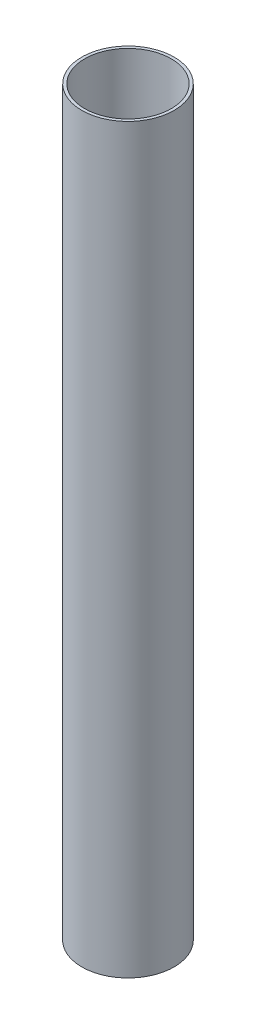
ISO-10303-21;
HEADER;
FILE_DESCRIPTION(('STEP AP214'),'2;1');
FILE_NAME('part.step','',(''),(''),'','','');
FILE_SCHEMA(('AUTOMOTIVE_DESIGN { 1 0 10303 214 1 1 1 1 }'));
ENDSEC;
DATA;
#1=APPLICATION_CONTEXT('core data for automotive mechanical design processes');
#2=APPLICATION_PROTOCOL_DEFINITION('international standard','automotive_design',2000,#1);
#3=PRODUCT_CONTEXT('',#1,'mechanical');
#4=PRODUCT('Part','Part','',(#3));
#5=PRODUCT_RELATED_PRODUCT_CATEGORY('part','',(#4));
#6=PRODUCT_DEFINITION_FORMATION('','',#4);
#7=PRODUCT_DEFINITION_CONTEXT('part definition',#1,'design');
#8=PRODUCT_DEFINITION('design','',#6,#7);
#9=PRODUCT_DEFINITION_SHAPE('','',#8);
#10=(LENGTH_UNIT() NAMED_UNIT(*) SI_UNIT(.MILLI.,.METRE.));
#11=(NAMED_UNIT(*) PLANE_ANGLE_UNIT() SI_UNIT($,.RADIAN.));
#12=(NAMED_UNIT(*) SI_UNIT($,.STERADIAN.) SOLID_ANGLE_UNIT());
#13=UNCERTAINTY_MEASURE_WITH_UNIT(LENGTH_MEASURE(1.E-05),#10,'distance_accuracy_value','');
#14=(GEOMETRIC_REPRESENTATION_CONTEXT(3) GLOBAL_UNCERTAINTY_ASSIGNED_CONTEXT((#13)) GLOBAL_UNIT_ASSIGNED_CONTEXT((#10,
#11,#12)) REPRESENTATION_CONTEXT('',''));
#15=CARTESIAN_POINT('',(0.,0.,0.));
#16=DIRECTION('',(0.,0.,1.));
#17=DIRECTION('',(1.,0.,0.));
#18=AXIS2_PLACEMENT_3D('',#15,#16,#17);
#19=CARTESIAN_POINT('',(0.,762.,0.));
#20=DIRECTION('',(0.,1.,0.));
#21=DIRECTION('',(0.,0.,1.));
#22=AXIS2_PLACEMENT_3D('',#19,#20,#21);
#23=PLANE('',#22);
#24=CARTESIAN_POINT('',(0.,762.,0.));
#25=DIRECTION('',(0.,1.,0.));
#26=DIRECTION('',(0.,0.,1.));
#27=AXIS2_PLACEMENT_3D('',#24,#25,#26);
#28=CIRCLE('',#27,47.449994);
#29=CARTESIAN_POINT('',(0.,762.,47.449994));
#30=VERTEX_POINT('',#29);
#31=EDGE_CURVE('E10',#30,#30,#28,.T.);
#32=ORIENTED_EDGE('',*,*,#31,.T.);
#33=EDGE_LOOP('',(#32));
#34=FACE_BOUND('',#33,.T.);
#35=CARTESIAN_POINT('',(0.,762.,0.));
#36=DIRECTION('',(0.,1.,0.));
#37=DIRECTION('',(0.,0.,1.));
#38=AXIS2_PLACEMENT_3D('',#35,#36,#37);
#39=CIRCLE('',#38,44.45);
#40=CARTESIAN_POINT('',(0.,762.,44.45));
#41=VERTEX_POINT('',#40);
#42=EDGE_CURVE('E42',#41,#41,#39,.T.);
#43=ORIENTED_EDGE('',*,*,#42,.F.);
#44=EDGE_LOOP('',(#43));
#45=FACE_BOUND('',#44,.T.);
#46=ADVANCED_FACE('F31',(#34,#45),#23,.T.);
#47=CARTESIAN_POINT('',(0.,0.,0.));
#48=DIRECTION('',(0.,1.,0.));
#49=DIRECTION('',(0.,0.,1.));
#50=AXIS2_PLACEMENT_3D('',#47,#48,#49);
#51=PLANE('',#50);
#52=CARTESIAN_POINT('',(0.,0.,0.));
#53=DIRECTION('',(0.,1.,0.));
#54=DIRECTION('',(0.,0.,1.));
#55=AXIS2_PLACEMENT_3D('',#52,#53,#54);
#56=CIRCLE('',#55,47.449994);
#57=CARTESIAN_POINT('',(0.,0.,47.449994));
#58=VERTEX_POINT('',#57);
#59=EDGE_CURVE('E35',#58,#58,#56,.T.);
#60=ORIENTED_EDGE('',*,*,#59,.F.);
#61=EDGE_LOOP('',(#60));
#62=FACE_BOUND('',#61,.T.);
#63=CARTESIAN_POINT('',(0.,0.,0.));
#64=DIRECTION('',(0.,1.,0.));
#65=DIRECTION('',(0.,0.,1.));
#66=AXIS2_PLACEMENT_3D('',#63,#64,#65);
#67=CIRCLE('',#66,44.45);
#68=CARTESIAN_POINT('',(0.,0.,44.45));
#69=VERTEX_POINT('',#68);
#70=EDGE_CURVE('E44',#69,#69,#67,.T.);
#71=ORIENTED_EDGE('',*,*,#70,.T.);
#72=EDGE_LOOP('',(#71));
#73=FACE_BOUND('',#72,.T.);
#74=ADVANCED_FACE('F54',(#62,#73),#51,.F.);
#75=CARTESIAN_POINT('',(0.,762.,0.));
#76=DIRECTION('',(0.,-1.,0.));
#77=DIRECTION('',(0.,0.,-1.));
#78=AXIS2_PLACEMENT_3D('',#75,#76,#77);
#79=CYLINDRICAL_SURFACE('',#78,47.449994);
#80=ORIENTED_EDGE('',*,*,#31,.F.);
#81=EDGE_LOOP('',(#80));
#82=FACE_BOUND('',#81,.T.);
#83=ORIENTED_EDGE('',*,*,#59,.T.);
#84=EDGE_LOOP('',(#83));
#85=FACE_BOUND('',#84,.T.);
#86=ADVANCED_FACE('F33',(#82,#85),#79,.T.);
#87=CARTESIAN_POINT('',(0.,762.,0.));
#88=DIRECTION('',(0.,-1.,0.));
#89=DIRECTION('',(0.,0.,-1.));
#90=AXIS2_PLACEMENT_3D('',#87,#88,#89);
#91=CYLINDRICAL_SURFACE('',#90,44.45);
#92=ORIENTED_EDGE('',*,*,#42,.T.);
#93=EDGE_LOOP('',(#92));
#94=FACE_BOUND('',#93,.T.);
#95=ORIENTED_EDGE('',*,*,#70,.F.);
#96=EDGE_LOOP('',(#95));
#97=FACE_BOUND('',#96,.T.);
#98=ADVANCED_FACE('F50',(#94,#97),#91,.F.);
#99=CLOSED_SHELL('',(#46,#74,#86,#98));
#100=MANIFOLD_SOLID_BREP('B2',#99);
#101=ADVANCED_BREP_SHAPE_REPRESENTATION('',(#18,#100),#14);
#102=SHAPE_DEFINITION_REPRESENTATION(#9,#101);
ENDSEC;
END-ISO-10303-21;
